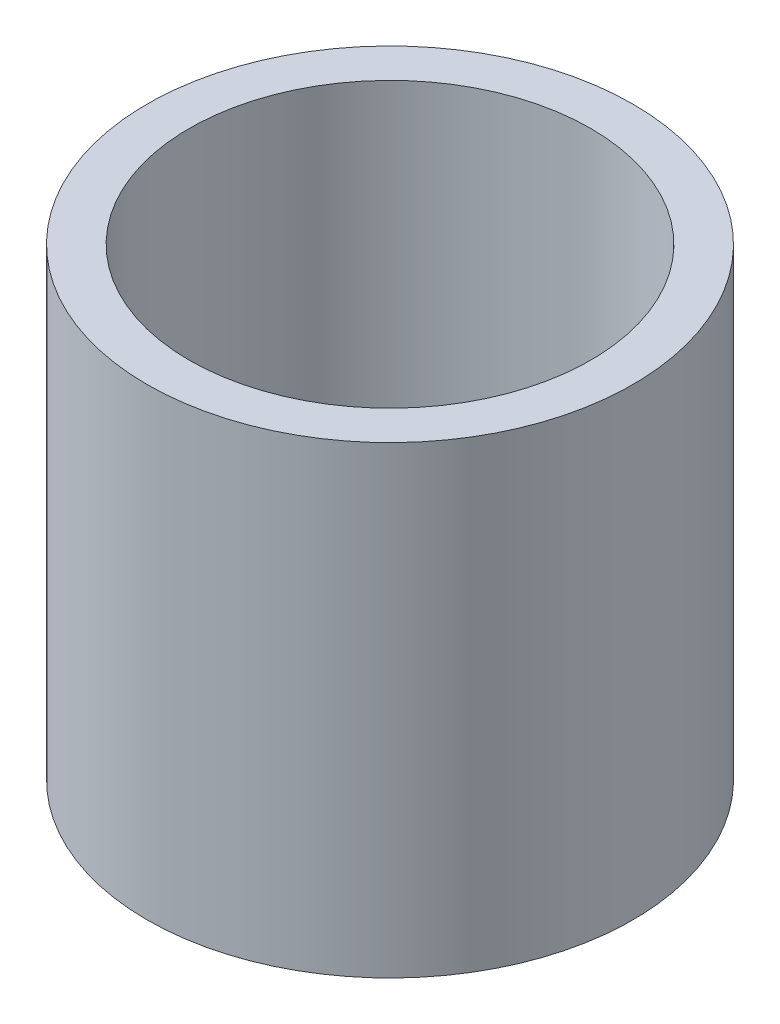
ISO-10303-21;
HEADER;
FILE_DESCRIPTION(('STEP AP214'),'2;1');
FILE_NAME('part.step','',(''),(''),'','','');
FILE_SCHEMA(('AUTOMOTIVE_DESIGN { 1 0 10303 214 1 1 1 1 }'));
ENDSEC;
DATA;
#1=APPLICATION_CONTEXT('core data for automotive mechanical design processes');
#2=APPLICATION_PROTOCOL_DEFINITION('international standard','automotive_design',2000,#1);
#3=PRODUCT_CONTEXT('',#1,'mechanical');
#4=PRODUCT('Part','Part','',(#3));
#5=PRODUCT_RELATED_PRODUCT_CATEGORY('part','',(#4));
#6=PRODUCT_DEFINITION_FORMATION('','',#4);
#7=PRODUCT_DEFINITION_CONTEXT('part definition',#1,'design');
#8=PRODUCT_DEFINITION('design','',#6,#7);
#9=PRODUCT_DEFINITION_SHAPE('','',#8);
#10=(LENGTH_UNIT() NAMED_UNIT(*) SI_UNIT(.MILLI.,.METRE.));
#11=(NAMED_UNIT(*) PLANE_ANGLE_UNIT() SI_UNIT($,.RADIAN.));
#12=(NAMED_UNIT(*) SI_UNIT($,.STERADIAN.) SOLID_ANGLE_UNIT());
#13=UNCERTAINTY_MEASURE_WITH_UNIT(LENGTH_MEASURE(1.E-05),#10,'distance_accuracy_value','');
#14=(GEOMETRIC_REPRESENTATION_CONTEXT(3) GLOBAL_UNCERTAINTY_ASSIGNED_CONTEXT((#13)) GLOBAL_UNIT_ASSIGNED_CONTEXT((#10,
#11,#12)) REPRESENTATION_CONTEXT('',''));
#15=CARTESIAN_POINT('',(0.,0.,0.));
#16=DIRECTION('',(0.,0.,1.));
#17=DIRECTION('',(1.,0.,0.));
#18=AXIS2_PLACEMENT_3D('',#15,#16,#17);
#19=CARTESIAN_POINT('',(0.,1.,0.));
#20=DIRECTION('',(0.,-1.,0.));
#21=DIRECTION('',(0.,0.,-1.));
#22=AXIS2_PLACEMENT_3D('',#19,#20,#21);
#23=CYLINDRICAL_SURFACE('',#22,5.7625);
#24=CARTESIAN_POINT('',(0.,0.,0.));
#25=DIRECTION('',(0.,1.,0.));
#26=DIRECTION('',(0.,0.,1.));
#27=AXIS2_PLACEMENT_3D('',#24,#25,#26);
#28=CIRCLE('',#27,5.7625);
#29=CARTESIAN_POINT('',(0.,0.,5.7625));
#30=VERTEX_POINT('',#29);
#31=EDGE_CURVE('E37',#30,#30,#28,.T.);
#32=ORIENTED_EDGE('',*,*,#31,.T.);
#33=EDGE_LOOP('',(#32));
#34=FACE_BOUND('',#33,.T.);
#35=CARTESIAN_POINT('',(0.,11.,0.));
#36=DIRECTION('',(0.,1.,0.));
#37=DIRECTION('',(0.,0.,1.));
#38=AXIS2_PLACEMENT_3D('',#35,#36,#37);
#39=CIRCLE('',#38,5.7625);
#40=CARTESIAN_POINT('',(0.,11.,5.7625));
#41=VERTEX_POINT('',#40);
#42=EDGE_CURVE('E41',#41,#41,#39,.T.);
#43=ORIENTED_EDGE('',*,*,#42,.F.);
#44=EDGE_LOOP('',(#43));
#45=FACE_BOUND('',#44,.T.);
#46=ADVANCED_FACE('F31',(#34,#45),#23,.T.);
#47=CARTESIAN_POINT('',(0.,0.,0.));
#48=DIRECTION('',(0.,1.,0.));
#49=DIRECTION('',(0.,0.,1.));
#50=AXIS2_PLACEMENT_3D('',#47,#48,#49);
#51=PLANE('',#50);
#52=ORIENTED_EDGE('',*,*,#31,.F.);
#53=EDGE_LOOP('',(#52));
#54=FACE_BOUND('',#53,.T.);
#55=ADVANCED_FACE('F55',(#54),#51,.F.);
#56=CARTESIAN_POINT('',(0.,11.,0.));
#57=DIRECTION('',(0.,1.,0.));
#58=DIRECTION('',(0.,0.,1.));
#59=AXIS2_PLACEMENT_3D('',#56,#57,#58);
#60=PLANE('',#59);
#61=ORIENTED_EDGE('',*,*,#42,.T.);
#62=EDGE_LOOP('',(#61));
#63=FACE_BOUND('',#62,.T.);
#64=CARTESIAN_POINT('',(0.,11.,0.));
#65=DIRECTION('',(0.,1.,0.));
#66=DIRECTION('',(0.,0.,1.));
#67=AXIS2_PLACEMENT_3D('',#64,#65,#66);
#68=CIRCLE('',#67,4.7625);
#69=CARTESIAN_POINT('',(0.,11.,4.7625));
#70=VERTEX_POINT('',#69);
#71=EDGE_CURVE('E45',#70,#70,#68,.T.);
#72=ORIENTED_EDGE('',*,*,#71,.F.);
#73=EDGE_LOOP('',(#72));
#74=FACE_BOUND('',#73,.T.);
#75=ADVANCED_FACE('F53',(#63,#74),#60,.T.);
#76=CARTESIAN_POINT('',(0.,11.,0.));
#77=DIRECTION('',(0.,-1.,0.));
#78=DIRECTION('',(0.,0.,-1.));
#79=AXIS2_PLACEMENT_3D('',#76,#77,#78);
#80=CYLINDRICAL_SURFACE('',#79,4.7625);
#81=ORIENTED_EDGE('',*,*,#71,.T.);
#82=EDGE_LOOP('',(#81));
#83=FACE_BOUND('',#82,.T.);
#84=CARTESIAN_POINT('',(0.,1.,0.));
#85=DIRECTION('',(0.,1.,0.));
#86=DIRECTION('',(0.,0.,1.));
#87=AXIS2_PLACEMENT_3D('',#84,#85,#86);
#88=CIRCLE('',#87,4.7625);
#89=CARTESIAN_POINT('',(0.,1.,4.7625));
#90=VERTEX_POINT('',#89);
#91=EDGE_CURVE('E10',#90,#90,#88,.F.);
#92=ORIENTED_EDGE('',*,*,#91,.T.);
#93=EDGE_LOOP('',(#92));
#94=FACE_BOUND('',#93,.T.);
#95=ADVANCED_FACE('F51',(#83,#94),#80,.F.);
#96=CARTESIAN_POINT('',(0.,1.,0.));
#97=DIRECTION('',(0.,1.,0.));
#98=DIRECTION('',(0.,0.,1.));
#99=AXIS2_PLACEMENT_3D('',#96,#97,#98);
#100=PLANE('',#99);
#101=ORIENTED_EDGE('',*,*,#91,.F.);
#102=EDGE_LOOP('',(#101));
#103=FACE_BOUND('',#102,.T.);
#104=ADVANCED_FACE('F62',(#103),#100,.T.);
#105=CLOSED_SHELL('',(#46,#55,#75,#95,#104));
#106=MANIFOLD_SOLID_BREP('B2',#105);
#107=ADVANCED_BREP_SHAPE_REPRESENTATION('',(#18,#106),#14);
#108=SHAPE_DEFINITION_REPRESENTATION(#9,#107);
ENDSEC;
END-ISO-10303-21;
